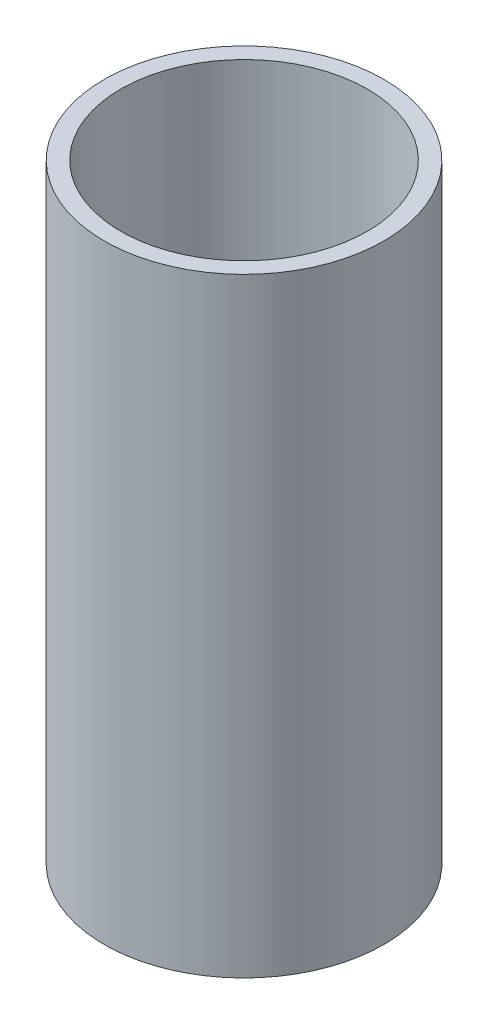
ISO-10303-21;
HEADER;
FILE_DESCRIPTION(('STEP AP214'),'2;1');
FILE_NAME('part.step','',(''),(''),'','','');
FILE_SCHEMA(('AUTOMOTIVE_DESIGN { 1 0 10303 214 1 1 1 1 }'));
ENDSEC;
DATA;
#1=APPLICATION_CONTEXT('core data for automotive mechanical design processes');
#2=APPLICATION_PROTOCOL_DEFINITION('international standard','automotive_design',2000,#1);
#3=PRODUCT_CONTEXT('',#1,'mechanical');
#4=PRODUCT('Part','Part','',(#3));
#5=PRODUCT_RELATED_PRODUCT_CATEGORY('part','',(#4));
#6=PRODUCT_DEFINITION_FORMATION('','',#4);
#7=PRODUCT_DEFINITION_CONTEXT('part definition',#1,'design');
#8=PRODUCT_DEFINITION('design','',#6,#7);
#9=PRODUCT_DEFINITION_SHAPE('','',#8);
#10=(LENGTH_UNIT() NAMED_UNIT(*) SI_UNIT(.MILLI.,.METRE.));
#11=(NAMED_UNIT(*) PLANE_ANGLE_UNIT() SI_UNIT($,.RADIAN.));
#12=(NAMED_UNIT(*) SI_UNIT($,.STERADIAN.) SOLID_ANGLE_UNIT());
#13=UNCERTAINTY_MEASURE_WITH_UNIT(LENGTH_MEASURE(1.E-05),#10,'distance_accuracy_value','');
#14=(GEOMETRIC_REPRESENTATION_CONTEXT(3) GLOBAL_UNCERTAINTY_ASSIGNED_CONTEXT((#13)) GLOBAL_UNIT_ASSIGNED_CONTEXT((#10,
#11,#12)) REPRESENTATION_CONTEXT('',''));
#15=CARTESIAN_POINT('',(0.,0.,0.));
#16=DIRECTION('',(0.,0.,1.));
#17=DIRECTION('',(1.,0.,0.));
#18=AXIS2_PLACEMENT_3D('',#15,#16,#17);
#19=CARTESIAN_POINT('',(0.,174.217820618924,0.));
#20=DIRECTION('',(0.,-1.,0.));
#21=DIRECTION('',(0.,0.,-1.));
#22=AXIS2_PLACEMENT_3D('',#19,#20,#21);
#23=CYLINDRICAL_SURFACE('',#22,40.);
#24=CARTESIAN_POINT('',(0.,174.217820618924,0.));
#25=DIRECTION('',(0.,1.,0.));
#26=DIRECTION('',(0.,0.,1.));
#27=AXIS2_PLACEMENT_3D('',#24,#25,#26);
#28=CIRCLE('',#27,40.);
#29=CARTESIAN_POINT('',(0.,174.217820618924,-40.));
#30=VERTEX_POINT('',#29);
#31=EDGE_CURVE('E10',#30,#30,#28,.T.);
#32=CARTESIAN_POINT('',(0.,0.,0.));
#33=DIRECTION('',(0.,1.,0.));
#34=DIRECTION('',(0.,0.,1.));
#35=AXIS2_PLACEMENT_3D('',#32,#33,#34);
#36=CIRCLE('',#35,40.);
#37=CARTESIAN_POINT('',(0.,0.,-40.));
#38=VERTEX_POINT('',#37);
#39=EDGE_CURVE('E37',#38,#38,#36,.T.);
#40=CARTESIAN_POINT('',(0.,174.217820618924,-40.));
#41=CARTESIAN_POINT('',(0.,172.403051654144,-40.));
#42=CARTESIAN_POINT('',(0.,170.588282689363,-40.));
#43=CARTESIAN_POINT('',(0.,166.958744759802,-40.));
#44=CARTESIAN_POINT('',(0.,165.143975795022,-40.));
#45=CARTESIAN_POINT('',(0.,161.514437865461,-40.));
#46=CARTESIAN_POINT('',(0.,159.69966890068,-40.));
#47=CARTESIAN_POINT('',(0.,156.070130971119,-40.));
#48=CARTESIAN_POINT('',(0.,154.255362006339,-40.));
#49=CARTESIAN_POINT('',(0.,150.625824076778,-40.));
#50=CARTESIAN_POINT('',(0.,148.811055111998,-40.));
#51=CARTESIAN_POINT('',(0.,145.181517182437,-40.));
#52=CARTESIAN_POINT('',(0.,143.366748217656,-40.));
#53=CARTESIAN_POINT('',(0.,139.737210288095,-40.));
#54=CARTESIAN_POINT('',(0.,137.922441323315,-40.));
#55=CARTESIAN_POINT('',(0.,134.292903393754,-40.));
#56=CARTESIAN_POINT('',(0.,132.478134428973,-40.));
#57=CARTESIAN_POINT('',(0.,128.848596499413,-40.));
#58=CARTESIAN_POINT('',(0.,127.033827534632,-40.));
#59=CARTESIAN_POINT('',(0.,123.404289605071,-40.));
#60=CARTESIAN_POINT('',(0.,121.589520640291,-40.));
#61=CARTESIAN_POINT('',(0.,117.95998271073,-40.));
#62=CARTESIAN_POINT('',(0.,116.145213745949,-40.));
#63=CARTESIAN_POINT('',(0.,112.515675816388,-40.));
#64=CARTESIAN_POINT('',(0.,110.700906851608,-40.));
#65=CARTESIAN_POINT('',(0.,107.071368922047,-40.));
#66=CARTESIAN_POINT('',(0.,105.256599957267,-40.));
#67=CARTESIAN_POINT('',(0.,101.627062027706,-40.));
#68=CARTESIAN_POINT('',(0.,99.8122930629252,-40.));
#69=CARTESIAN_POINT('',(0.,96.1827551333643,-40.));
#70=CARTESIAN_POINT('',(0.,94.3679861685838,-40.));
#71=CARTESIAN_POINT('',(0.,90.7384482390229,-40.));
#72=CARTESIAN_POINT('',(0.,88.9236792742424,-40.));
#73=CARTESIAN_POINT('',(0.,85.2941413446815,-40.));
#74=CARTESIAN_POINT('',(0.,83.4793723799011,-40.));
#75=CARTESIAN_POINT('',(0.,79.8498344503402,-40.));
#76=CARTESIAN_POINT('',(0.,78.0350654855597,-40.));
#77=CARTESIAN_POINT('',(0.,74.4055275559988,-40.));
#78=CARTESIAN_POINT('',(0.,72.5907585912183,-40.));
#79=CARTESIAN_POINT('',(0.,68.9612206616574,-40.));
#80=CARTESIAN_POINT('',(0.,67.1464516968769,-40.));
#81=CARTESIAN_POINT('',(0.,63.516913767316,-40.));
#82=CARTESIAN_POINT('',(0.,61.7021448025356,-40.));
#83=CARTESIAN_POINT('',(0.,58.0726068729747,-40.));
#84=CARTESIAN_POINT('',(0.,56.2578379081942,-40.));
#85=CARTESIAN_POINT('',(0.,52.6282999786333,-40.));
#86=CARTESIAN_POINT('',(0.,50.8135310138528,-40.));
#87=CARTESIAN_POINT('',(0.,47.1839930842919,-40.));
#88=CARTESIAN_POINT('',(0.,45.3692241195114,-40.));
#89=CARTESIAN_POINT('',(0.,41.7396861899505,-40.));
#90=CARTESIAN_POINT('',(0.,39.9249172251701,-40.));
#91=CARTESIAN_POINT('',(0.,36.2953792956091,-40.));
#92=CARTESIAN_POINT('',(0.,34.4806103308287,-40.));
#93=CARTESIAN_POINT('',(0.,30.8510724012678,-40.));
#94=CARTESIAN_POINT('',(0.,29.0363034364873,-40.));
#95=CARTESIAN_POINT('',(0.,25.4067655069264,-40.));
#96=CARTESIAN_POINT('',(0.,23.5919965421459,-40.));
#97=CARTESIAN_POINT('',(0.,19.962458612585,-40.));
#98=CARTESIAN_POINT('',(0.,18.1476896478046,-40.));
#99=CARTESIAN_POINT('',(0.,14.5181517182436,-40.));
#100=CARTESIAN_POINT('',(0.,12.7033827534632,-40.));
#101=CARTESIAN_POINT('',(0.,9.07384482390227,-40.));
#102=CARTESIAN_POINT('',(0.,7.25907585912181,-40.));
#103=CARTESIAN_POINT('',(0.,3.6295379295609,-40.));
#104=CARTESIAN_POINT('',(0.,1.81476896478044,-40.));
#105=CARTESIAN_POINT('',(0.,0.,-40.));
#106=B_SPLINE_CURVE_WITH_KNOTS('',3,(#40,#41,#42,#43,#44,#45,#46,#47,#48,#49,#50,#51,#52,#53,
#54,#55,#56,#57,#58,#59,#60,#61,#62,#63,#64,#65,#66,#67,#68,#69,#70,#71,#72,#73,#74,#75,#76,#77,
#78,#79,#80,#81,#82,#83,#84,#85,#86,#87,#88,#89,#90,#91,#92,#93,#94,#95,#96,#97,#98,#99,#100,
#101,#102,#103,#104,#105),.UNSPECIFIED.,.F.,.F.,(4,2,2,2,2,2,2,2,2,2,2,2,2,2,2,2,2,2,2,2,2,2,2,
2,2,2,2,2,2,2,2,2,4),(0.,5.44430689434136,10.8886137886827,16.3329206830241,21.7772275773655,
27.2215344717069,32.6658413660482,38.1101482603896,43.554455154731,48.9987620490724,
54.4430689434137,59.8873758377551,65.3316827320965,70.7759896264379,76.2202965207792,
81.6646034151206,87.108910309462,92.5532172038034,97.9975240981447,103.441830992486,
108.886137886827,114.330444781169,119.77475167551,125.219058569852,130.663365464193,
136.107672358534,141.551979252876,146.996286147217,152.440593041558,157.8848999359,
163.329206830241,168.773513724583,174.217820618924),.UNSPECIFIED.);
#107=EDGE_CURVE('BSEAM40',#30,#38,#106,.T.);
#108=ORIENTED_EDGE('',*,*,#31,.F.);
#109=ORIENTED_EDGE('',*,*,#39,.T.);
#110=ORIENTED_EDGE('',*,*,#107,.T.);
#111=ORIENTED_EDGE('',*,*,#107,.F.);
#112=EDGE_LOOP('',(#108,#110,#109,#111));
#113=FACE_BOUND('',#112,.T.);
#114=ADVANCED_FACE('F40',(#113),#23,.T.);
#115=CARTESIAN_POINT('',(0.,174.217820618924,0.));
#116=DIRECTION('',(0.,1.,0.));
#117=DIRECTION('',(0.,0.,1.));
#118=AXIS2_PLACEMENT_3D('',#115,#116,#117);
#119=PLANE('',#118);
#120=CARTESIAN_POINT('',(0.,174.217820618924,0.));
#121=DIRECTION('',(0.,1.,0.));
#122=DIRECTION('',(0.,0.,1.));
#123=AXIS2_PLACEMENT_3D('',#120,#121,#122);
#124=CIRCLE('',#123,35.2461059927015);
#125=CARTESIAN_POINT('',(0.,174.217820618924,-35.2461059927015));
#126=VERTEX_POINT('',#125);
#127=EDGE_CURVE('E50',#126,#126,#124,.T.);
#128=ORIENTED_EDGE('',*,*,#127,.F.);
#129=EDGE_LOOP('',(#128));
#130=FACE_BOUND('',#129,.T.);
#131=ORIENTED_EDGE('',*,*,#31,.T.);
#132=EDGE_LOOP('',(#131));
#133=FACE_BOUND('',#132,.T.);
#134=ADVANCED_FACE('F59',(#130,#133),#119,.T.);
#135=CARTESIAN_POINT('',(0.,0.,0.));
#136=DIRECTION('',(0.,1.,0.));
#137=DIRECTION('',(0.,0.,1.));
#138=AXIS2_PLACEMENT_3D('',#135,#136,#137);
#139=PLANE('',#138);
#140=CARTESIAN_POINT('',(0.,0.,0.));
#141=DIRECTION('',(0.,1.,0.));
#142=DIRECTION('',(0.,0.,1.));
#143=AXIS2_PLACEMENT_3D('',#140,#141,#142);
#144=CIRCLE('',#143,35.2461059927015);
#145=CARTESIAN_POINT('',(0.,0.,-35.2461059927015));
#146=VERTEX_POINT('',#145);
#147=EDGE_CURVE('E47',#146,#146,#144,.T.);
#148=ORIENTED_EDGE('',*,*,#147,.T.);
#149=EDGE_LOOP('',(#148));
#150=FACE_BOUND('',#149,.T.);
#151=ORIENTED_EDGE('',*,*,#39,.F.);
#152=EDGE_LOOP('',(#151));
#153=FACE_BOUND('',#152,.T.);
#154=ADVANCED_FACE('F58',(#150,#153),#139,.F.);
#155=CARTESIAN_POINT('',(0.,174.217820618924,0.));
#156=DIRECTION('',(0.,-1.,0.));
#157=DIRECTION('',(0.,0.,-1.));
#158=AXIS2_PLACEMENT_3D('',#155,#156,#157);
#159=CYLINDRICAL_SURFACE('',#158,35.2461059927015);
#160=CARTESIAN_POINT('',(0.,174.217820618924,-35.2461059927015));
#161=CARTESIAN_POINT('',(0.,172.403051654144,-35.2461059927015));
#162=CARTESIAN_POINT('',(0.,170.588282689363,-35.2461059927015));
#163=CARTESIAN_POINT('',(0.,166.958744759802,-35.2461059927015));
#164=CARTESIAN_POINT('',(0.,165.143975795022,-35.2461059927015));
#165=CARTESIAN_POINT('',(0.,161.514437865461,-35.2461059927015));
#166=CARTESIAN_POINT('',(0.,159.69966890068,-35.2461059927015));
#167=CARTESIAN_POINT('',(0.,156.070130971119,-35.2461059927015));
#168=CARTESIAN_POINT('',(0.,154.255362006339,-35.2461059927015));
#169=CARTESIAN_POINT('',(0.,150.625824076778,-35.2461059927015));
#170=CARTESIAN_POINT('',(0.,148.811055111998,-35.2461059927015));
#171=CARTESIAN_POINT('',(0.,145.181517182437,-35.2461059927015));
#172=CARTESIAN_POINT('',(0.,143.366748217656,-35.2461059927015));
#173=CARTESIAN_POINT('',(0.,139.737210288095,-35.2461059927015));
#174=CARTESIAN_POINT('',(0.,137.922441323315,-35.2461059927015));
#175=CARTESIAN_POINT('',(0.,134.292903393754,-35.2461059927015));
#176=CARTESIAN_POINT('',(0.,132.478134428973,-35.2461059927015));
#177=CARTESIAN_POINT('',(0.,128.848596499413,-35.2461059927015));
#178=CARTESIAN_POINT('',(0.,127.033827534632,-35.2461059927015));
#179=CARTESIAN_POINT('',(0.,123.404289605071,-35.2461059927015));
#180=CARTESIAN_POINT('',(0.,121.589520640291,-35.2461059927015));
#181=CARTESIAN_POINT('',(0.,117.95998271073,-35.2461059927015));
#182=CARTESIAN_POINT('',(0.,116.145213745949,-35.2461059927015));
#183=CARTESIAN_POINT('',(0.,112.515675816388,-35.2461059927015));
#184=CARTESIAN_POINT('',(0.,110.700906851608,-35.2461059927015));
#185=CARTESIAN_POINT('',(0.,107.071368922047,-35.2461059927015));
#186=CARTESIAN_POINT('',(0.,105.256599957267,-35.2461059927015));
#187=CARTESIAN_POINT('',(0.,101.627062027706,-35.2461059927015));
#188=CARTESIAN_POINT('',(0.,99.8122930629252,-35.2461059927015));
#189=CARTESIAN_POINT('',(0.,96.1827551333643,-35.2461059927015));
#190=CARTESIAN_POINT('',(0.,94.3679861685838,-35.2461059927015));
#191=CARTESIAN_POINT('',(0.,90.7384482390229,-35.2461059927015));
#192=CARTESIAN_POINT('',(0.,88.9236792742424,-35.2461059927015));
#193=CARTESIAN_POINT('',(0.,85.2941413446815,-35.2461059927015));
#194=CARTESIAN_POINT('',(0.,83.4793723799011,-35.2461059927015));
#195=CARTESIAN_POINT('',(0.,79.8498344503402,-35.2461059927015));
#196=CARTESIAN_POINT('',(0.,78.0350654855597,-35.2461059927015));
#197=CARTESIAN_POINT('',(0.,74.4055275559988,-35.2461059927015));
#198=CARTESIAN_POINT('',(0.,72.5907585912183,-35.2461059927015));
#199=CARTESIAN_POINT('',(0.,68.9612206616574,-35.2461059927015));
#200=CARTESIAN_POINT('',(0.,67.1464516968769,-35.2461059927015));
#201=CARTESIAN_POINT('',(0.,63.516913767316,-35.2461059927015));
#202=CARTESIAN_POINT('',(0.,61.7021448025356,-35.2461059927015));
#203=CARTESIAN_POINT('',(0.,58.0726068729747,-35.2461059927015));
#204=CARTESIAN_POINT('',(0.,56.2578379081942,-35.2461059927015));
#205=CARTESIAN_POINT('',(0.,52.6282999786333,-35.2461059927015));
#206=CARTESIAN_POINT('',(0.,50.8135310138528,-35.2461059927015));
#207=CARTESIAN_POINT('',(0.,47.1839930842919,-35.2461059927015));
#208=CARTESIAN_POINT('',(0.,45.3692241195114,-35.2461059927015));
#209=CARTESIAN_POINT('',(0.,41.7396861899505,-35.2461059927015));
#210=CARTESIAN_POINT('',(0.,39.9249172251701,-35.2461059927015));
#211=CARTESIAN_POINT('',(0.,36.2953792956091,-35.2461059927015));
#212=CARTESIAN_POINT('',(0.,34.4806103308287,-35.2461059927015));
#213=CARTESIAN_POINT('',(0.,30.8510724012678,-35.2461059927015));
#214=CARTESIAN_POINT('',(0.,29.0363034364873,-35.2461059927015));
#215=CARTESIAN_POINT('',(0.,25.4067655069264,-35.2461059927015));
#216=CARTESIAN_POINT('',(0.,23.5919965421459,-35.2461059927015));
#217=CARTESIAN_POINT('',(0.,19.962458612585,-35.2461059927015));
#218=CARTESIAN_POINT('',(0.,18.1476896478046,-35.2461059927015));
#219=CARTESIAN_POINT('',(0.,14.5181517182436,-35.2461059927015));
#220=CARTESIAN_POINT('',(0.,12.7033827534632,-35.2461059927015));
#221=CARTESIAN_POINT('',(0.,9.07384482390227,-35.2461059927015));
#222=CARTESIAN_POINT('',(0.,7.25907585912181,-35.2461059927015));
#223=CARTESIAN_POINT('',(0.,3.6295379295609,-35.2461059927015));
#224=CARTESIAN_POINT('',(0.,1.81476896478044,-35.2461059927015));
#225=CARTESIAN_POINT('',(0.,0.,-35.2461059927015));
#226=B_SPLINE_CURVE_WITH_KNOTS('',3,(#160,#161,#162,#163,#164,#165,#166,#167,#168,#169,#170,
#171,#172,#173,#174,#175,#176,#177,#178,#179,#180,#181,#182,#183,#184,#185,#186,#187,#188,#189,
#190,#191,#192,#193,#194,#195,#196,#197,#198,#199,#200,#201,#202,#203,#204,#205,#206,#207,#208,
#209,#210,#211,#212,#213,#214,#215,#216,#217,#218,#219,#220,#221,#222,#223,#224,#225),
.UNSPECIFIED.,.F.,.F.,(4,2,2,2,2,2,2,2,2,2,2,2,2,2,2,2,2,2,2,2,2,2,2,2,2,2,2,2,2,2,2,2,4),(0.,
5.44430689434136,10.8886137886827,16.3329206830241,21.7772275773655,27.2215344717069,
32.6658413660482,38.1101482603896,43.554455154731,48.9987620490724,54.4430689434137,
59.8873758377551,65.3316827320965,70.7759896264379,76.2202965207792,81.6646034151206,
87.108910309462,92.5532172038034,97.9975240981447,103.441830992486,108.886137886827,
114.330444781169,119.77475167551,125.219058569852,130.663365464193,136.107672358534,
141.551979252876,146.996286147217,152.440593041558,157.8848999359,163.329206830241,
168.773513724583,174.217820618924),.UNSPECIFIED.);
#227=EDGE_CURVE('BSEAM54',#126,#146,#226,.T.);
#228=ORIENTED_EDGE('',*,*,#127,.T.);
#229=ORIENTED_EDGE('',*,*,#147,.F.);
#230=ORIENTED_EDGE('',*,*,#227,.T.);
#231=ORIENTED_EDGE('',*,*,#227,.F.);
#232=EDGE_LOOP('',(#228,#230,#229,#231));
#233=FACE_BOUND('',#232,.T.);
#234=ADVANCED_FACE('F54',(#233),#159,.F.);
#235=CLOSED_SHELL('',(#114,#134,#154,#234));
#236=MANIFOLD_SOLID_BREP('B2',#235);
#237=ADVANCED_BREP_SHAPE_REPRESENTATION('',(#18,#236),#14);
#238=SHAPE_DEFINITION_REPRESENTATION(#9,#237);
ENDSEC;
END-ISO-10303-21;
